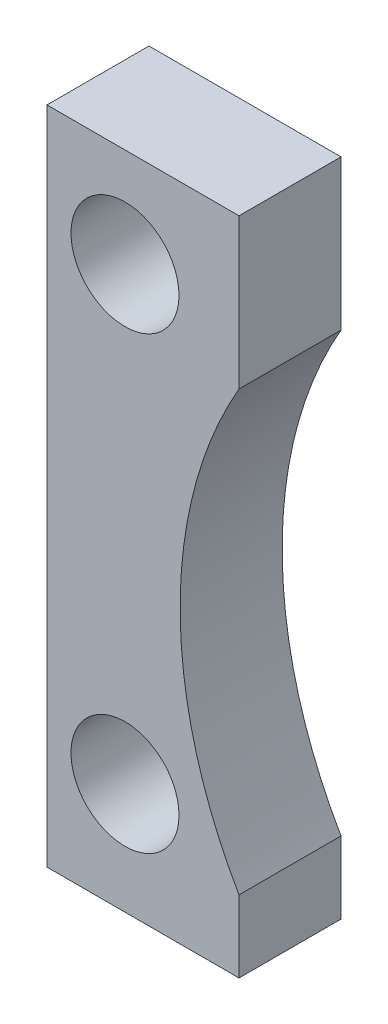
ISO-10303-21;
HEADER;
FILE_DESCRIPTION(('STEP AP214'),'2;1');
FILE_NAME('part.step','',(''),(''),'','','');
FILE_SCHEMA(('AUTOMOTIVE_DESIGN { 1 0 10303 214 1 1 1 1 }'));
ENDSEC;
DATA;
#1=APPLICATION_CONTEXT('core data for automotive mechanical design processes');
#2=APPLICATION_PROTOCOL_DEFINITION('international standard','automotive_design',2000,#1);
#3=PRODUCT_CONTEXT('',#1,'mechanical');
#4=PRODUCT('Part','Part','',(#3));
#5=PRODUCT_RELATED_PRODUCT_CATEGORY('part','',(#4));
#6=PRODUCT_DEFINITION_FORMATION('','',#4);
#7=PRODUCT_DEFINITION_CONTEXT('part definition',#1,'design');
#8=PRODUCT_DEFINITION('design','',#6,#7);
#9=PRODUCT_DEFINITION_SHAPE('','',#8);
#10=(LENGTH_UNIT() NAMED_UNIT(*) SI_UNIT(.MILLI.,.METRE.));
#11=(NAMED_UNIT(*) PLANE_ANGLE_UNIT() SI_UNIT($,.RADIAN.));
#12=(NAMED_UNIT(*) SI_UNIT($,.STERADIAN.) SOLID_ANGLE_UNIT());
#13=UNCERTAINTY_MEASURE_WITH_UNIT(LENGTH_MEASURE(1.E-05),#10,'distance_accuracy_value','');
#14=(GEOMETRIC_REPRESENTATION_CONTEXT(3) GLOBAL_UNCERTAINTY_ASSIGNED_CONTEXT((#13)) GLOBAL_UNIT_ASSIGNED_CONTEXT((#10,
#11,#12)) REPRESENTATION_CONTEXT('',''));
#15=CARTESIAN_POINT('',(0.,0.,0.));
#16=DIRECTION('',(0.,0.,1.));
#17=DIRECTION('',(1.,0.,0.));
#18=AXIS2_PLACEMENT_3D('',#15,#16,#17);
#19=CARTESIAN_POINT('',(0.,0.,8.5));
#20=DIRECTION('',(0.,1.,0.));
#21=DIRECTION('',(0.,0.,1.));
#22=AXIS2_PLACEMENT_3D('',#19,#20,#21);
#23=PLANE('',#22);
#24=DIRECTION('',(1.,0.,0.));
#25=VECTOR('',#24,1.);
#26=CARTESIAN_POINT('',(0.,0.,-8.5));
#27=LINE('',#26,#25);
#28=CARTESIAN_POINT('',(0.,0.,-8.5));
#29=VERTEX_POINT('',#28);
#30=CARTESIAN_POINT('',(32.,0.,-8.5));
#31=VERTEX_POINT('',#30);
#32=EDGE_CURVE('E118',#29,#31,#27,.T.);
#33=ORIENTED_EDGE('',*,*,#32,.T.);
#34=DIRECTION('',(0.,0.,-1.));
#35=VECTOR('',#34,1.);
#36=CARTESIAN_POINT('',(32.,0.,8.5));
#37=LINE('',#36,#35);
#38=CARTESIAN_POINT('',(32.,0.,8.5));
#39=VERTEX_POINT('',#38);
#40=EDGE_CURVE('E11',#39,#31,#37,.T.);
#41=ORIENTED_EDGE('',*,*,#40,.F.);
#42=DIRECTION('',(1.,0.,0.));
#43=VECTOR('',#42,1.);
#44=CARTESIAN_POINT('',(0.,0.,8.5));
#45=LINE('',#44,#43);
#46=CARTESIAN_POINT('',(0.,0.,8.5));
#47=VERTEX_POINT('',#46);
#48=EDGE_CURVE('E129',#47,#39,#45,.T.);
#49=ORIENTED_EDGE('',*,*,#48,.F.);
#50=DIRECTION('',(0.,0.,-1.));
#51=VECTOR('',#50,1.);
#52=CARTESIAN_POINT('',(0.,0.,8.5));
#53=LINE('',#52,#51);
#54=EDGE_CURVE('E114',#47,#29,#53,.T.);
#55=ORIENTED_EDGE('',*,*,#54,.T.);
#56=EDGE_LOOP('',(#33,#41,#49,#55));
#57=FACE_BOUND('',#56,.T.);
#58=ADVANCED_FACE('F34',(#57),#23,.F.);
#59=CARTESIAN_POINT('',(32.,0.,8.5));
#60=DIRECTION('',(-1.,0.,0.));
#61=DIRECTION('',(0.,-1.,0.));
#62=AXIS2_PLACEMENT_3D('',#59,#60,#61);
#63=PLANE('',#62);
#64=DIRECTION('',(0.,1.,0.));
#65=VECTOR('',#64,1.);
#66=CARTESIAN_POINT('',(32.,0.,-8.5));
#67=LINE('',#66,#65);
#68=CARTESIAN_POINT('',(32.,12.,-8.5));
#69=VERTEX_POINT('',#68);
#70=EDGE_CURVE('E121',#31,#69,#67,.T.);
#71=ORIENTED_EDGE('',*,*,#70,.T.);
#72=DIRECTION('',(0.,0.,-1.));
#73=VECTOR('',#72,1.);
#74=CARTESIAN_POINT('',(32.,12.,8.5));
#75=LINE('',#74,#73);
#76=CARTESIAN_POINT('',(32.,12.,8.5));
#77=VERTEX_POINT('',#76);
#78=EDGE_CURVE('E42',#77,#69,#75,.T.);
#79=ORIENTED_EDGE('',*,*,#78,.F.);
#80=DIRECTION('',(0.,1.,0.));
#81=VECTOR('',#80,1.);
#82=CARTESIAN_POINT('',(32.,0.,8.5));
#83=LINE('',#82,#81);
#84=EDGE_CURVE('E87',#39,#77,#83,.T.);
#85=ORIENTED_EDGE('',*,*,#84,.F.);
#86=ORIENTED_EDGE('',*,*,#40,.T.);
#87=EDGE_LOOP('',(#71,#79,#85,#86));
#88=FACE_BOUND('',#87,.T.);
#89=ADVANCED_FACE('F154',(#88),#63,.F.);
#90=CARTESIAN_POINT('',(95.,48.5,8.5));
#91=DIRECTION('',(0.,0.,-1.));
#92=DIRECTION('',(-1.,0.,0.));
#93=AXIS2_PLACEMENT_3D('',#90,#91,#92);
#94=CYLINDRICAL_SURFACE('',#93,72.8096834219185);
#95=CARTESIAN_POINT('',(95.,48.5,-8.5));
#96=DIRECTION('',(0.,0.,-1.));
#97=DIRECTION('',(-1.,0.,0.));
#98=AXIS2_PLACEMENT_3D('',#95,#96,#97);
#99=CIRCLE('',#98,72.8096834219185);
#100=CARTESIAN_POINT('',(32.,85.,-8.5));
#101=VERTEX_POINT('',#100);
#102=EDGE_CURVE('E124',#69,#101,#99,.T.);
#103=ORIENTED_EDGE('',*,*,#102,.T.);
#104=DIRECTION('',(0.,0.,-1.));
#105=VECTOR('',#104,1.);
#106=CARTESIAN_POINT('',(32.,85.,8.5));
#107=LINE('',#106,#105);
#108=CARTESIAN_POINT('',(32.,85.,8.5));
#109=VERTEX_POINT('',#108);
#110=EDGE_CURVE('E109',#109,#101,#107,.T.);
#111=ORIENTED_EDGE('',*,*,#110,.F.);
#112=CARTESIAN_POINT('',(95.,48.5,8.5));
#113=DIRECTION('',(0.,0.,-1.));
#114=DIRECTION('',(-1.,0.,0.));
#115=AXIS2_PLACEMENT_3D('',#112,#113,#114);
#116=CIRCLE('',#115,72.8096834219185);
#117=EDGE_CURVE('E100',#77,#109,#116,.T.);
#118=ORIENTED_EDGE('',*,*,#117,.F.);
#119=ORIENTED_EDGE('',*,*,#78,.T.);
#120=EDGE_LOOP('',(#103,#111,#118,#119));
#121=FACE_BOUND('',#120,.T.);
#122=ADVANCED_FACE('F135',(#121),#94,.F.);
#123=CARTESIAN_POINT('',(32.,110.,8.5));
#124=DIRECTION('',(-1.,0.,0.));
#125=DIRECTION('',(0.,-1.,0.));
#126=AXIS2_PLACEMENT_3D('',#123,#124,#125);
#127=PLANE('',#126);
#128=DIRECTION('',(0.,1.,0.));
#129=VECTOR('',#128,1.);
#130=CARTESIAN_POINT('',(32.,110.,-8.5));
#131=LINE('',#130,#129);
#132=CARTESIAN_POINT('',(32.,110.,-8.5));
#133=VERTEX_POINT('',#132);
#134=EDGE_CURVE('E108',#101,#133,#131,.T.);
#135=ORIENTED_EDGE('',*,*,#134,.T.);
#136=DIRECTION('',(0.,0.,-1.));
#137=VECTOR('',#136,1.);
#138=CARTESIAN_POINT('',(32.,110.,8.5));
#139=LINE('',#138,#137);
#140=CARTESIAN_POINT('',(32.,110.,8.5));
#141=VERTEX_POINT('',#140);
#142=EDGE_CURVE('E105',#141,#133,#139,.T.);
#143=ORIENTED_EDGE('',*,*,#142,.F.);
#144=DIRECTION('',(0.,1.,0.));
#145=VECTOR('',#144,1.);
#146=CARTESIAN_POINT('',(32.,110.,8.5));
#147=LINE('',#146,#145);
#148=EDGE_CURVE('E94',#109,#141,#147,.T.);
#149=ORIENTED_EDGE('',*,*,#148,.F.);
#150=ORIENTED_EDGE('',*,*,#110,.T.);
#151=EDGE_LOOP('',(#135,#143,#149,#150));
#152=FACE_BOUND('',#151,.T.);
#153=ADVANCED_FACE('F106',(#152),#127,.F.);
#154=CARTESIAN_POINT('',(0.,110.,8.5));
#155=DIRECTION('',(0.,-1.,0.));
#156=DIRECTION('',(0.,0.,-1.));
#157=AXIS2_PLACEMENT_3D('',#154,#155,#156);
#158=PLANE('',#157);
#159=DIRECTION('',(-1.,0.,0.));
#160=VECTOR('',#159,1.);
#161=CARTESIAN_POINT('',(0.,110.,-8.5));
#162=LINE('',#161,#160);
#163=CARTESIAN_POINT('',(0.,110.,-8.5));
#164=VERTEX_POINT('',#163);
#165=EDGE_CURVE('E73',#133,#164,#162,.T.);
#166=ORIENTED_EDGE('',*,*,#165,.T.);
#167=DIRECTION('',(0.,0.,-1.));
#168=VECTOR('',#167,1.);
#169=CARTESIAN_POINT('',(0.,110.,8.5));
#170=LINE('',#169,#168);
#171=CARTESIAN_POINT('',(0.,110.,8.5));
#172=VERTEX_POINT('',#171);
#173=EDGE_CURVE('E110',#172,#164,#170,.T.);
#174=ORIENTED_EDGE('',*,*,#173,.F.);
#175=DIRECTION('',(-1.,0.,0.));
#176=VECTOR('',#175,1.);
#177=CARTESIAN_POINT('',(0.,110.,8.5));
#178=LINE('',#177,#176);
#179=EDGE_CURVE('E98',#141,#172,#178,.T.);
#180=ORIENTED_EDGE('',*,*,#179,.F.);
#181=ORIENTED_EDGE('',*,*,#142,.T.);
#182=EDGE_LOOP('',(#166,#174,#180,#181));
#183=FACE_BOUND('',#182,.T.);
#184=ADVANCED_FACE('F112',(#183),#158,.F.);
#185=CARTESIAN_POINT('',(0.,0.,8.5));
#186=DIRECTION('',(1.,0.,0.));
#187=DIRECTION('',(0.,0.,-1.));
#188=AXIS2_PLACEMENT_3D('',#185,#186,#187);
#189=PLANE('',#188);
#190=DIRECTION('',(0.,-1.,0.));
#191=VECTOR('',#190,1.);
#192=CARTESIAN_POINT('',(0.,0.,-8.5));
#193=LINE('',#192,#191);
#194=EDGE_CURVE('E79',#164,#29,#193,.T.);
#195=ORIENTED_EDGE('',*,*,#194,.T.);
#196=ORIENTED_EDGE('',*,*,#54,.F.);
#197=DIRECTION('',(0.,-1.,0.));
#198=VECTOR('',#197,1.);
#199=CARTESIAN_POINT('',(0.,0.,8.5));
#200=LINE('',#199,#198);
#201=EDGE_CURVE('E50',#172,#47,#200,.T.);
#202=ORIENTED_EDGE('',*,*,#201,.F.);
#203=ORIENTED_EDGE('',*,*,#173,.T.);
#204=EDGE_LOOP('',(#195,#196,#202,#203));
#205=FACE_BOUND('',#204,.T.);
#206=ADVANCED_FACE('F142',(#205),#189,.F.);
#207=CARTESIAN_POINT('',(95.,48.5,8.5));
#208=DIRECTION('',(0.,0.,-1.));
#209=DIRECTION('',(-1.,0.,0.));
#210=AXIS2_PLACEMENT_3D('',#207,#208,#209);
#211=PLANE('',#210);
#212=CARTESIAN_POINT('',(13.,93.5,8.5));
#213=DIRECTION('',(0.,0.,1.));
#214=DIRECTION('',(1.,0.,0.));
#215=AXIS2_PLACEMENT_3D('',#212,#213,#214);
#216=CIRCLE('',#215,9.00000000000002);
#217=CARTESIAN_POINT('',(22.0000000000001,93.5,8.5));
#218=VERTEX_POINT('',#217);
#219=EDGE_CURVE('E219',#218,#218,#216,.T.);
#220=ORIENTED_EDGE('',*,*,#219,.F.);
#221=EDGE_LOOP('',(#220));
#222=FACE_BOUND('',#221,.T.);
#223=CARTESIAN_POINT('',(13.0000000000001,18.5,8.5));
#224=DIRECTION('',(0.,0.,1.));
#225=DIRECTION('',(1.,0.,0.));
#226=AXIS2_PLACEMENT_3D('',#223,#224,#225);
#227=CIRCLE('',#226,9.);
#228=CARTESIAN_POINT('',(22.0000000000001,18.5,8.5));
#229=VERTEX_POINT('',#228);
#230=EDGE_CURVE('E224',#229,#229,#227,.T.);
#231=ORIENTED_EDGE('',*,*,#230,.F.);
#232=EDGE_LOOP('',(#231));
#233=FACE_BOUND('',#232,.T.);
#234=ORIENTED_EDGE('',*,*,#48,.T.);
#235=ORIENTED_EDGE('',*,*,#84,.T.);
#236=ORIENTED_EDGE('',*,*,#117,.T.);
#237=ORIENTED_EDGE('',*,*,#148,.T.);
#238=ORIENTED_EDGE('',*,*,#179,.T.);
#239=ORIENTED_EDGE('',*,*,#201,.T.);
#240=EDGE_LOOP('',(#234,#235,#236,#237,#238,#239));
#241=FACE_BOUND('',#240,.T.);
#242=ADVANCED_FACE('F96',(#222,#233,#241),#211,.F.);
#243=CARTESIAN_POINT('',(95.,48.5,-8.5));
#244=DIRECTION('',(0.,0.,-1.));
#245=DIRECTION('',(-1.,0.,0.));
#246=AXIS2_PLACEMENT_3D('',#243,#244,#245);
#247=PLANE('',#246);
#248=CARTESIAN_POINT('',(13.,93.5,-8.5));
#249=DIRECTION('',(0.,0.,1.));
#250=DIRECTION('',(1.,0.,0.));
#251=AXIS2_PLACEMENT_3D('',#248,#249,#250);
#252=CIRCLE('',#251,9.00000000000002);
#253=CARTESIAN_POINT('',(22.0000000000001,93.5,-8.5));
#254=VERTEX_POINT('',#253);
#255=EDGE_CURVE('E122',#254,#254,#252,.T.);
#256=ORIENTED_EDGE('',*,*,#255,.T.);
#257=EDGE_LOOP('',(#256));
#258=FACE_BOUND('',#257,.T.);
#259=CARTESIAN_POINT('',(13.0000000000001,18.5,-8.5));
#260=DIRECTION('',(0.,0.,1.));
#261=DIRECTION('',(1.,0.,0.));
#262=AXIS2_PLACEMENT_3D('',#259,#260,#261);
#263=CIRCLE('',#262,9.);
#264=CARTESIAN_POINT('',(22.0000000000001,18.5,-8.5));
#265=VERTEX_POINT('',#264);
#266=EDGE_CURVE('E220',#265,#265,#263,.T.);
#267=ORIENTED_EDGE('',*,*,#266,.T.);
#268=EDGE_LOOP('',(#267));
#269=FACE_BOUND('',#268,.T.);
#270=ORIENTED_EDGE('',*,*,#32,.F.);
#271=ORIENTED_EDGE('',*,*,#194,.F.);
#272=ORIENTED_EDGE('',*,*,#165,.F.);
#273=ORIENTED_EDGE('',*,*,#134,.F.);
#274=ORIENTED_EDGE('',*,*,#102,.F.);
#275=ORIENTED_EDGE('',*,*,#70,.F.);
#276=EDGE_LOOP('',(#270,#271,#272,#273,#274,#275));
#277=FACE_BOUND('',#276,.T.);
#278=ADVANCED_FACE('F138',(#258,#269,#277),#247,.T.);
#279=CARTESIAN_POINT('',(13.0000000000001,18.5,-8.5));
#280=DIRECTION('',(0.,0.,1.));
#281=DIRECTION('',(1.,0.,0.));
#282=AXIS2_PLACEMENT_3D('',#279,#280,#281);
#283=CYLINDRICAL_SURFACE('',#282,9.);
#284=ORIENTED_EDGE('',*,*,#266,.F.);
#285=EDGE_LOOP('',(#284));
#286=FACE_BOUND('',#285,.T.);
#287=ORIENTED_EDGE('',*,*,#230,.T.);
#288=EDGE_LOOP('',(#287));
#289=FACE_BOUND('',#288,.T.);
#290=ADVANCED_FACE('F191',(#286,#289),#283,.F.);
#291=CARTESIAN_POINT('',(13.,93.5,-8.5));
#292=DIRECTION('',(0.,0.,1.));
#293=DIRECTION('',(1.,0.,0.));
#294=AXIS2_PLACEMENT_3D('',#291,#292,#293);
#295=CYLINDRICAL_SURFACE('',#294,9.00000000000002);
#296=ORIENTED_EDGE('',*,*,#255,.F.);
#297=EDGE_LOOP('',(#296));
#298=FACE_BOUND('',#297,.T.);
#299=ORIENTED_EDGE('',*,*,#219,.T.);
#300=EDGE_LOOP('',(#299));
#301=FACE_BOUND('',#300,.T.);
#302=ADVANCED_FACE('F200',(#298,#301),#295,.F.);
#303=CLOSED_SHELL('',(#58,#89,#122,#153,#184,#206,#242,#278,#290,#302));
#304=MANIFOLD_SOLID_BREP('B2',#303);
#305=ADVANCED_BREP_SHAPE_REPRESENTATION('',(#18,#304),#14);
#306=SHAPE_DEFINITION_REPRESENTATION(#9,#305);
ENDSEC;
END-ISO-10303-21;
